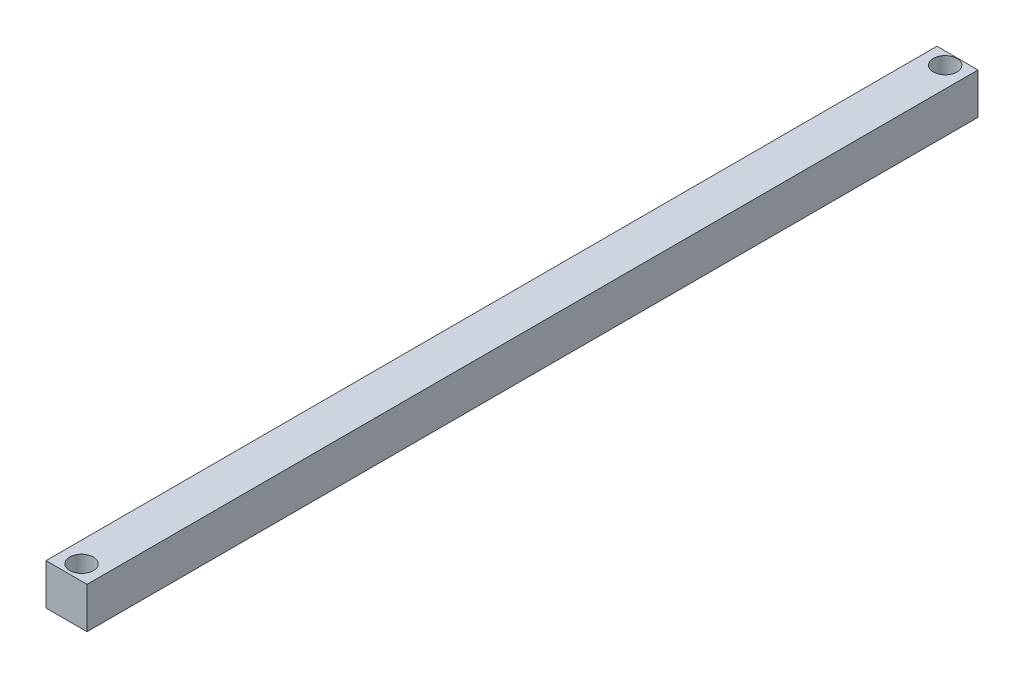
ISO-10303-21;
HEADER;
FILE_DESCRIPTION(('STEP AP214'),'2;1');
FILE_NAME('part.step','',(''),(''),'','','');
FILE_SCHEMA(('AUTOMOTIVE_DESIGN { 1 0 10303 214 1 1 1 1 }'));
ENDSEC;
DATA;
#1=APPLICATION_CONTEXT('core data for automotive mechanical design processes');
#2=APPLICATION_PROTOCOL_DEFINITION('international standard','automotive_design',2000,#1);
#3=PRODUCT_CONTEXT('',#1,'mechanical');
#4=PRODUCT('Part','Part','',(#3));
#5=PRODUCT_RELATED_PRODUCT_CATEGORY('part','',(#4));
#6=PRODUCT_DEFINITION_FORMATION('','',#4);
#7=PRODUCT_DEFINITION_CONTEXT('part definition',#1,'design');
#8=PRODUCT_DEFINITION('design','',#6,#7);
#9=PRODUCT_DEFINITION_SHAPE('','',#8);
#10=(LENGTH_UNIT() NAMED_UNIT(*) SI_UNIT(.MILLI.,.METRE.));
#11=(NAMED_UNIT(*) PLANE_ANGLE_UNIT() SI_UNIT($,.RADIAN.));
#12=(NAMED_UNIT(*) SI_UNIT($,.STERADIAN.) SOLID_ANGLE_UNIT());
#13=UNCERTAINTY_MEASURE_WITH_UNIT(LENGTH_MEASURE(1.E-05),#10,'distance_accuracy_value','');
#14=(GEOMETRIC_REPRESENTATION_CONTEXT(3) GLOBAL_UNCERTAINTY_ASSIGNED_CONTEXT((#13)) GLOBAL_UNIT_ASSIGNED_CONTEXT((#10,
#11,#12)) REPRESENTATION_CONTEXT('',''));
#15=CARTESIAN_POINT('',(0.,0.,0.));
#16=DIRECTION('',(0.,0.,1.));
#17=DIRECTION('',(1.,0.,0.));
#18=AXIS2_PLACEMENT_3D('',#15,#16,#17);
#19=CARTESIAN_POINT('',(9.99999999999997,20.,-217.));
#20=DIRECTION('',(-1.,0.,0.));
#21=DIRECTION('',(0.,0.,1.));
#22=AXIS2_PLACEMENT_3D('',#19,#20,#21);
#23=PLANE('',#22);
#24=DIRECTION('',(0.,0.,-1.));
#25=VECTOR('',#24,1.);
#26=CARTESIAN_POINT('',(9.99999999999997,0.,-217.));
#27=LINE('',#26,#25);
#28=CARTESIAN_POINT('',(10.,0.,217.));
#29=VERTEX_POINT('',#28);
#30=CARTESIAN_POINT('',(9.99999999999997,0.,-217.));
#31=VERTEX_POINT('',#30);
#32=EDGE_CURVE('E109',#29,#31,#27,.T.);
#33=ORIENTED_EDGE('',*,*,#32,.T.);
#34=DIRECTION('',(0.,-1.,0.));
#35=VECTOR('',#34,1.);
#36=CARTESIAN_POINT('',(9.99999999999997,20.,-217.));
#37=LINE('',#36,#35);
#38=CARTESIAN_POINT('',(9.99999999999997,20.,-217.));
#39=VERTEX_POINT('',#38);
#40=EDGE_CURVE('E11',#39,#31,#37,.T.);
#41=ORIENTED_EDGE('',*,*,#40,.F.);
#42=DIRECTION('',(0.,0.,-1.));
#43=VECTOR('',#42,1.);
#44=CARTESIAN_POINT('',(9.99999999999997,20.,-217.));
#45=LINE('',#44,#43);
#46=CARTESIAN_POINT('',(10.,20.,217.));
#47=VERTEX_POINT('',#46);
#48=EDGE_CURVE('E93',#47,#39,#45,.T.);
#49=ORIENTED_EDGE('',*,*,#48,.F.);
#50=DIRECTION('',(0.,-1.,0.));
#51=VECTOR('',#50,1.);
#52=CARTESIAN_POINT('',(10.,20.,217.));
#53=LINE('',#52,#51);
#54=EDGE_CURVE('E105',#47,#29,#53,.T.);
#55=ORIENTED_EDGE('',*,*,#54,.T.);
#56=EDGE_LOOP('',(#33,#41,#49,#55));
#57=FACE_BOUND('',#56,.T.);
#58=ADVANCED_FACE('F41',(#57),#23,.F.);
#59=CARTESIAN_POINT('',(-10.,20.,-217.));
#60=DIRECTION('',(0.,0.,1.));
#61=DIRECTION('',(1.,0.,0.));
#62=AXIS2_PLACEMENT_3D('',#59,#60,#61);
#63=PLANE('',#62);
#64=DIRECTION('',(-1.,0.,0.));
#65=VECTOR('',#64,1.);
#66=CARTESIAN_POINT('',(-10.,0.,-217.));
#67=LINE('',#66,#65);
#68=CARTESIAN_POINT('',(-10.,0.,-217.));
#69=VERTEX_POINT('',#68);
#70=EDGE_CURVE('E98',#31,#69,#67,.T.);
#71=ORIENTED_EDGE('',*,*,#70,.T.);
#72=DIRECTION('',(0.,-1.,0.));
#73=VECTOR('',#72,1.);
#74=CARTESIAN_POINT('',(-10.,20.,-217.));
#75=LINE('',#74,#73);
#76=CARTESIAN_POINT('',(-10.,20.,-217.));
#77=VERTEX_POINT('',#76);
#78=EDGE_CURVE('E50',#77,#69,#75,.T.);
#79=ORIENTED_EDGE('',*,*,#78,.F.);
#80=DIRECTION('',(-1.,0.,0.));
#81=VECTOR('',#80,1.);
#82=CARTESIAN_POINT('',(-10.,20.,-217.));
#83=LINE('',#82,#81);
#84=EDGE_CURVE('E88',#39,#77,#83,.T.);
#85=ORIENTED_EDGE('',*,*,#84,.F.);
#86=ORIENTED_EDGE('',*,*,#40,.T.);
#87=EDGE_LOOP('',(#71,#79,#85,#86));
#88=FACE_BOUND('',#87,.T.);
#89=ADVANCED_FACE('F97',(#88),#63,.F.);
#90=CARTESIAN_POINT('',(-10.,20.,-217.));
#91=DIRECTION('',(1.,0.,0.));
#92=DIRECTION('',(0.,0.,-1.));
#93=AXIS2_PLACEMENT_3D('',#90,#91,#92);
#94=PLANE('',#93);
#95=DIRECTION('',(0.,0.,1.));
#96=VECTOR('',#95,1.);
#97=CARTESIAN_POINT('',(-10.,0.,-217.));
#98=LINE('',#97,#96);
#99=CARTESIAN_POINT('',(-9.99999999999998,0.,217.));
#100=VERTEX_POINT('',#99);
#101=EDGE_CURVE('E75',#69,#100,#98,.T.);
#102=ORIENTED_EDGE('',*,*,#101,.T.);
#103=DIRECTION('',(0.,-1.,0.));
#104=VECTOR('',#103,1.);
#105=CARTESIAN_POINT('',(-9.99999999999998,20.,217.));
#106=LINE('',#105,#104);
#107=CARTESIAN_POINT('',(-9.99999999999998,20.,217.));
#108=VERTEX_POINT('',#107);
#109=EDGE_CURVE('E100',#108,#100,#106,.T.);
#110=ORIENTED_EDGE('',*,*,#109,.F.);
#111=DIRECTION('',(0.,0.,1.));
#112=VECTOR('',#111,1.);
#113=CARTESIAN_POINT('',(-10.,20.,-217.));
#114=LINE('',#113,#112);
#115=EDGE_CURVE('E91',#77,#108,#114,.T.);
#116=ORIENTED_EDGE('',*,*,#115,.F.);
#117=ORIENTED_EDGE('',*,*,#78,.T.);
#118=EDGE_LOOP('',(#102,#110,#116,#117));
#119=FACE_BOUND('',#118,.T.);
#120=ADVANCED_FACE('F101',(#119),#94,.F.);
#121=CARTESIAN_POINT('',(-9.99999999999998,20.,217.));
#122=DIRECTION('',(0.,0.,-1.));
#123=DIRECTION('',(-1.,0.,0.));
#124=AXIS2_PLACEMENT_3D('',#121,#122,#123);
#125=PLANE('',#124);
#126=DIRECTION('',(1.,0.,0.));
#127=VECTOR('',#126,1.);
#128=CARTESIAN_POINT('',(-9.99999999999998,0.,217.));
#129=LINE('',#128,#127);
#130=EDGE_CURVE('E81',#100,#29,#129,.T.);
#131=ORIENTED_EDGE('',*,*,#130,.T.);
#132=ORIENTED_EDGE('',*,*,#54,.F.);
#133=DIRECTION('',(1.,0.,0.));
#134=VECTOR('',#133,1.);
#135=CARTESIAN_POINT('',(-9.99999999999998,20.,217.));
#136=LINE('',#135,#134);
#137=EDGE_CURVE('E58',#108,#47,#136,.T.);
#138=ORIENTED_EDGE('',*,*,#137,.F.);
#139=ORIENTED_EDGE('',*,*,#109,.T.);
#140=EDGE_LOOP('',(#131,#132,#138,#139));
#141=FACE_BOUND('',#140,.T.);
#142=ADVANCED_FACE('F123',(#141),#125,.F.);
#143=CARTESIAN_POINT('',(0.,20.,0.));
#144=DIRECTION('',(0.,1.,0.));
#145=DIRECTION('',(0.,0.,1.));
#146=AXIS2_PLACEMENT_3D('',#143,#144,#145);
#147=PLANE('',#146);
#148=CARTESIAN_POINT('',(0.,20.,-211.));
#149=DIRECTION('',(0.,1.,0.));
#150=DIRECTION('',(0.,0.,1.));
#151=AXIS2_PLACEMENT_3D('',#148,#149,#150);
#152=CIRCLE('',#151,5.75000000000001);
#153=CARTESIAN_POINT('',(0.,20.,-205.25));
#154=VERTEX_POINT('',#153);
#155=EDGE_CURVE('E138',#154,#154,#152,.T.);
#156=ORIENTED_EDGE('',*,*,#155,.F.);
#157=EDGE_LOOP('',(#156));
#158=FACE_BOUND('',#157,.T.);
#159=CARTESIAN_POINT('',(0.,20.,209.68));
#160=DIRECTION('',(0.,1.,0.));
#161=DIRECTION('',(0.,0.,1.));
#162=AXIS2_PLACEMENT_3D('',#159,#160,#161);
#163=CIRCLE('',#162,5.75000000000001);
#164=CARTESIAN_POINT('',(0.,20.,215.43));
#165=VERTEX_POINT('',#164);
#166=EDGE_CURVE('E130',#165,#165,#163,.T.);
#167=ORIENTED_EDGE('',*,*,#166,.F.);
#168=EDGE_LOOP('',(#167));
#169=FACE_BOUND('',#168,.T.);
#170=ORIENTED_EDGE('',*,*,#48,.T.);
#171=ORIENTED_EDGE('',*,*,#84,.T.);
#172=ORIENTED_EDGE('',*,*,#115,.T.);
#173=ORIENTED_EDGE('',*,*,#137,.T.);
#174=EDGE_LOOP('',(#170,#171,#172,#173));
#175=FACE_BOUND('',#174,.T.);
#176=ADVANCED_FACE('F89',(#158,#169,#175),#147,.T.);
#177=CARTESIAN_POINT('',(0.,0.,0.));
#178=DIRECTION('',(0.,1.,0.));
#179=DIRECTION('',(0.,0.,1.));
#180=AXIS2_PLACEMENT_3D('',#177,#178,#179);
#181=PLANE('',#180);
#182=CARTESIAN_POINT('',(0.,0.,-211.));
#183=DIRECTION('',(0.,1.,0.));
#184=DIRECTION('',(0.,0.,1.));
#185=AXIS2_PLACEMENT_3D('',#182,#183,#184);
#186=CIRCLE('',#185,5.75000000000001);
#187=CARTESIAN_POINT('',(0.,0.,-205.25));
#188=VERTEX_POINT('',#187);
#189=EDGE_CURVE('E113',#188,#188,#186,.T.);
#190=ORIENTED_EDGE('',*,*,#189,.T.);
#191=EDGE_LOOP('',(#190));
#192=FACE_BOUND('',#191,.T.);
#193=CARTESIAN_POINT('',(0.,0.,209.68));
#194=DIRECTION('',(0.,1.,0.));
#195=DIRECTION('',(0.,0.,1.));
#196=AXIS2_PLACEMENT_3D('',#193,#194,#195);
#197=CIRCLE('',#196,5.75000000000001);
#198=CARTESIAN_POINT('',(0.,0.,215.43));
#199=VERTEX_POINT('',#198);
#200=EDGE_CURVE('E134',#199,#199,#197,.T.);
#201=ORIENTED_EDGE('',*,*,#200,.T.);
#202=EDGE_LOOP('',(#201));
#203=FACE_BOUND('',#202,.T.);
#204=ORIENTED_EDGE('',*,*,#32,.F.);
#205=ORIENTED_EDGE('',*,*,#130,.F.);
#206=ORIENTED_EDGE('',*,*,#101,.F.);
#207=ORIENTED_EDGE('',*,*,#70,.F.);
#208=EDGE_LOOP('',(#204,#205,#206,#207));
#209=FACE_BOUND('',#208,.T.);
#210=ADVANCED_FACE('F126',(#192,#203,#209),#181,.F.);
#211=CARTESIAN_POINT('',(0.,0.,209.68));
#212=DIRECTION('',(0.,1.,0.));
#213=DIRECTION('',(0.,0.,1.));
#214=AXIS2_PLACEMENT_3D('',#211,#212,#213);
#215=CYLINDRICAL_SURFACE('',#214,5.75000000000001);
#216=ORIENTED_EDGE('',*,*,#200,.F.);
#217=EDGE_LOOP('',(#216));
#218=FACE_BOUND('',#217,.T.);
#219=ORIENTED_EDGE('',*,*,#166,.T.);
#220=EDGE_LOOP('',(#219));
#221=FACE_BOUND('',#220,.T.);
#222=ADVANCED_FACE('F151',(#218,#221),#215,.F.);
#223=CARTESIAN_POINT('',(0.,0.,-211.));
#224=DIRECTION('',(0.,1.,0.));
#225=DIRECTION('',(0.,0.,1.));
#226=AXIS2_PLACEMENT_3D('',#223,#224,#225);
#227=CYLINDRICAL_SURFACE('',#226,5.75000000000001);
#228=ORIENTED_EDGE('',*,*,#189,.F.);
#229=EDGE_LOOP('',(#228));
#230=FACE_BOUND('',#229,.T.);
#231=ORIENTED_EDGE('',*,*,#155,.T.);
#232=EDGE_LOOP('',(#231));
#233=FACE_BOUND('',#232,.T.);
#234=ADVANCED_FACE('F148',(#230,#233),#227,.F.);
#235=CLOSED_SHELL('',(#58,#89,#120,#142,#176,#210,#222,#234));
#236=MANIFOLD_SOLID_BREP('B2',#235);
#237=ADVANCED_BREP_SHAPE_REPRESENTATION('',(#18,#236),#14);
#238=SHAPE_DEFINITION_REPRESENTATION(#9,#237);
ENDSEC;
END-ISO-10303-21;
